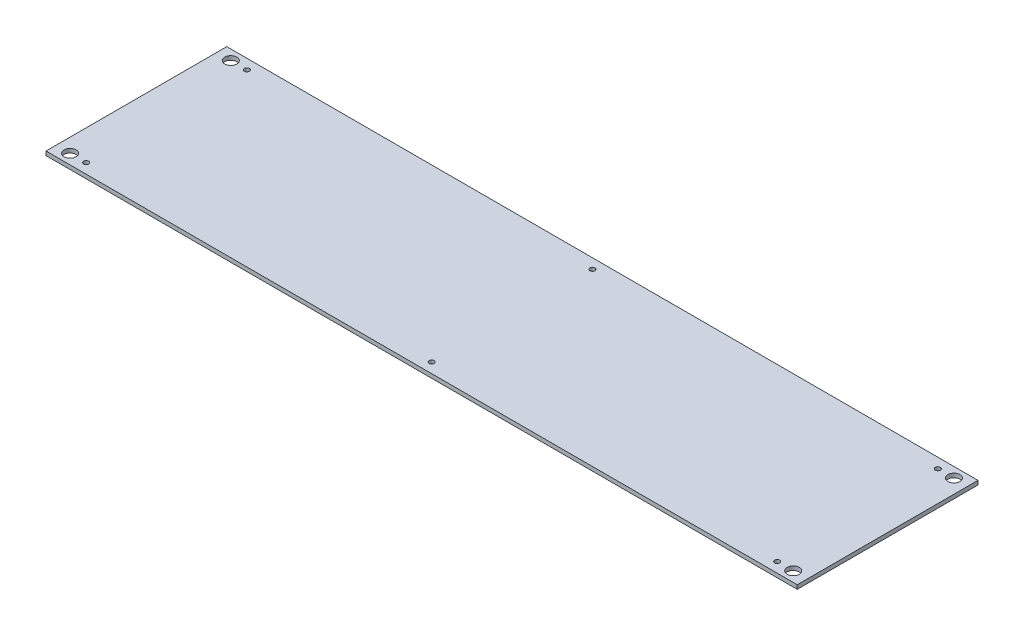
ISO-10303-21;
HEADER;
FILE_DESCRIPTION(('STEP AP214'),'2;1');
FILE_NAME('part.step','',(''),(''),'','','');
FILE_SCHEMA(('AUTOMOTIVE_DESIGN { 1 0 10303 214 1 1 1 1 }'));
ENDSEC;
DATA;
#1=APPLICATION_CONTEXT('core data for automotive mechanical design processes');
#2=APPLICATION_PROTOCOL_DEFINITION('international standard','automotive_design',2000,#1);
#3=PRODUCT_CONTEXT('',#1,'mechanical');
#4=PRODUCT('Part','Part','',(#3));
#5=PRODUCT_RELATED_PRODUCT_CATEGORY('part','',(#4));
#6=PRODUCT_DEFINITION_FORMATION('','',#4);
#7=PRODUCT_DEFINITION_CONTEXT('part definition',#1,'design');
#8=PRODUCT_DEFINITION('design','',#6,#7);
#9=PRODUCT_DEFINITION_SHAPE('','',#8);
#10=(LENGTH_UNIT() NAMED_UNIT(*) SI_UNIT(.MILLI.,.METRE.));
#11=(NAMED_UNIT(*) PLANE_ANGLE_UNIT() SI_UNIT($,.RADIAN.));
#12=(NAMED_UNIT(*) SI_UNIT($,.STERADIAN.) SOLID_ANGLE_UNIT());
#13=UNCERTAINTY_MEASURE_WITH_UNIT(LENGTH_MEASURE(1.E-05),#10,'distance_accuracy_value','');
#14=(GEOMETRIC_REPRESENTATION_CONTEXT(3) GLOBAL_UNCERTAINTY_ASSIGNED_CONTEXT((#13)) GLOBAL_UNIT_ASSIGNED_CONTEXT((#10,
#11,#12)) REPRESENTATION_CONTEXT('',''));
#15=CARTESIAN_POINT('',(0.,0.,0.));
#16=DIRECTION('',(0.,0.,1.));
#17=DIRECTION('',(1.,0.,0.));
#18=AXIS2_PLACEMENT_3D('',#15,#16,#17);
#19=CARTESIAN_POINT('',(0.,4.,0.));
#20=DIRECTION('',(0.,-1.,0.));
#21=DIRECTION('',(0.,0.,-1.));
#22=AXIS2_PLACEMENT_3D('',#19,#20,#21);
#23=PLANE('',#22);
#24=DIRECTION('',(0.,0.,-1.));
#25=VECTOR('',#24,1.);
#26=CARTESIAN_POINT('',(374.,4.,89.9999999999997));
#27=LINE('',#26,#25);
#28=CARTESIAN_POINT('',(374.,4.,89.9999999999997));
#29=VERTEX_POINT('',#28);
#30=CARTESIAN_POINT('',(374.,4.,-89.9999999999997));
#31=VERTEX_POINT('',#30);
#32=EDGE_CURVE('E92',#29,#31,#27,.T.);
#33=ORIENTED_EDGE('',*,*,#32,.T.);
#34=DIRECTION('',(-1.,0.,0.));
#35=VECTOR('',#34,1.);
#36=CARTESIAN_POINT('',(-374.,4.,-90.));
#37=LINE('',#36,#35);
#38=CARTESIAN_POINT('',(-374.,4.,-90.));
#39=VERTEX_POINT('',#38);
#40=EDGE_CURVE('E87',#31,#39,#37,.T.);
#41=ORIENTED_EDGE('',*,*,#40,.T.);
#42=DIRECTION('',(0.,0.,1.));
#43=VECTOR('',#42,1.);
#44=CARTESIAN_POINT('',(-374.,4.,90.));
#45=LINE('',#44,#43);
#46=CARTESIAN_POINT('',(-374.,4.,90.));
#47=VERTEX_POINT('',#46);
#48=EDGE_CURVE('E90',#39,#47,#45,.T.);
#49=ORIENTED_EDGE('',*,*,#48,.T.);
#50=DIRECTION('',(1.,0.,0.));
#51=VECTOR('',#50,1.);
#52=CARTESIAN_POINT('',(-374.,4.,90.));
#53=LINE('',#52,#51);
#54=EDGE_CURVE('E57',#47,#29,#53,.T.);
#55=ORIENTED_EDGE('',*,*,#54,.T.);
#56=EDGE_LOOP('',(#33,#41,#49,#55));
#57=FACE_BOUND('',#56,.T.);
#58=CARTESIAN_POINT('',(-344.,4.,-80.));
#59=DIRECTION('',(0.,1.,0.));
#60=DIRECTION('',(0.,0.,1.));
#61=AXIS2_PLACEMENT_3D('',#58,#59,#60);
#62=CIRCLE('',#61,2.50000000000002);
#63=CARTESIAN_POINT('',(-344.,4.,-77.5));
#64=VERTEX_POINT('',#63);
#65=EDGE_CURVE('E112',#64,#64,#62,.T.);
#66=ORIENTED_EDGE('',*,*,#65,.F.);
#67=EDGE_LOOP('',(#66));
#68=FACE_BOUND('',#67,.T.);
#69=CARTESIAN_POINT('',(344.,4.,-80.0000000000001));
#70=DIRECTION('',(0.,1.,0.));
#71=DIRECTION('',(0.,0.,-1.));
#72=AXIS2_PLACEMENT_3D('',#69,#70,#71);
#73=CIRCLE('',#72,2.50000000000002);
#74=CARTESIAN_POINT('',(344.,4.,-82.5000000000001));
#75=VERTEX_POINT('',#74);
#76=EDGE_CURVE('E134',#75,#75,#73,.T.);
#77=ORIENTED_EDGE('',*,*,#76,.F.);
#78=EDGE_LOOP('',(#77));
#79=FACE_BOUND('',#78,.T.);
#80=CARTESIAN_POINT('',(0.,4.,-80.));
#81=DIRECTION('',(0.,1.,0.));
#82=DIRECTION('',(0.,0.,1.));
#83=AXIS2_PLACEMENT_3D('',#80,#81,#82);
#84=CIRCLE('',#83,2.5);
#85=CARTESIAN_POINT('',(0.,4.,-77.5));
#86=VERTEX_POINT('',#85);
#87=EDGE_CURVE('E142',#86,#86,#84,.T.);
#88=ORIENTED_EDGE('',*,*,#87,.F.);
#89=EDGE_LOOP('',(#88));
#90=FACE_BOUND('',#89,.T.);
#91=CARTESIAN_POINT('',(-344.,4.,80.));
#92=DIRECTION('',(0.,1.,0.));
#93=DIRECTION('',(0.,0.,-1.));
#94=AXIS2_PLACEMENT_3D('',#91,#92,#93);
#95=CIRCLE('',#94,2.50000000000002);
#96=CARTESIAN_POINT('',(-344.,4.,77.5));
#97=VERTEX_POINT('',#96);
#98=EDGE_CURVE('E150',#97,#97,#95,.T.);
#99=ORIENTED_EDGE('',*,*,#98,.F.);
#100=EDGE_LOOP('',(#99));
#101=FACE_BOUND('',#100,.T.);
#102=CARTESIAN_POINT('',(0.,4.,80.0000000000001));
#103=DIRECTION('',(0.,1.,0.));
#104=DIRECTION('',(0.,0.,-1.));
#105=AXIS2_PLACEMENT_3D('',#102,#103,#104);
#106=CIRCLE('',#105,2.5);
#107=CARTESIAN_POINT('',(0.,4.,77.5000000000001));
#108=VERTEX_POINT('',#107);
#109=EDGE_CURVE('E158',#108,#108,#106,.T.);
#110=ORIENTED_EDGE('',*,*,#109,.F.);
#111=EDGE_LOOP('',(#110));
#112=FACE_BOUND('',#111,.T.);
#113=CARTESIAN_POINT('',(344.,4.,80.0000000000001));
#114=DIRECTION('',(0.,1.,0.));
#115=DIRECTION('',(0.,0.,1.));
#116=AXIS2_PLACEMENT_3D('',#113,#114,#115);
#117=CIRCLE('',#116,2.50000000000002);
#118=CARTESIAN_POINT('',(344.,4.,82.5000000000001));
#119=VERTEX_POINT('',#118);
#120=EDGE_CURVE('E166',#119,#119,#117,.T.);
#121=ORIENTED_EDGE('',*,*,#120,.F.);
#122=EDGE_LOOP('',(#121));
#123=FACE_BOUND('',#122,.T.);
#124=CARTESIAN_POINT('',(-360.,4.,-80.));
#125=DIRECTION('',(0.,1.,0.));
#126=DIRECTION('',(0.,0.,1.));
#127=AXIS2_PLACEMENT_3D('',#124,#125,#126);
#128=CIRCLE('',#127,5.99999999999999);
#129=CARTESIAN_POINT('',(-360.,4.,-74.));
#130=VERTEX_POINT('',#129);
#131=EDGE_CURVE('E174',#130,#130,#128,.T.);
#132=ORIENTED_EDGE('',*,*,#131,.F.);
#133=EDGE_LOOP('',(#132));
#134=FACE_BOUND('',#133,.T.);
#135=CARTESIAN_POINT('',(-360.,4.,80.));
#136=DIRECTION('',(0.,1.,0.));
#137=DIRECTION('',(0.,0.,-1.));
#138=AXIS2_PLACEMENT_3D('',#135,#136,#137);
#139=CIRCLE('',#138,5.99999999999999);
#140=CARTESIAN_POINT('',(-360.,4.,74.));
#141=VERTEX_POINT('',#140);
#142=EDGE_CURVE('E182',#141,#141,#139,.T.);
#143=ORIENTED_EDGE('',*,*,#142,.F.);
#144=EDGE_LOOP('',(#143));
#145=FACE_BOUND('',#144,.T.);
#146=CARTESIAN_POINT('',(360.,4.,79.9999999999999));
#147=DIRECTION('',(0.,1.,0.));
#148=DIRECTION('',(0.,0.,1.));
#149=AXIS2_PLACEMENT_3D('',#146,#147,#148);
#150=CIRCLE('',#149,5.99999999999999);
#151=CARTESIAN_POINT('',(360.,4.,85.9999999999999));
#152=VERTEX_POINT('',#151);
#153=EDGE_CURVE('E190',#152,#152,#150,.T.);
#154=ORIENTED_EDGE('',*,*,#153,.F.);
#155=EDGE_LOOP('',(#154));
#156=FACE_BOUND('',#155,.T.);
#157=CARTESIAN_POINT('',(360.,4.,-80.));
#158=DIRECTION('',(0.,1.,0.));
#159=DIRECTION('',(0.,0.,-1.));
#160=AXIS2_PLACEMENT_3D('',#157,#158,#159);
#161=CIRCLE('',#160,5.99999999999999);
#162=CARTESIAN_POINT('',(360.,4.,-86.));
#163=VERTEX_POINT('',#162);
#164=EDGE_CURVE('E198',#163,#163,#161,.T.);
#165=ORIENTED_EDGE('',*,*,#164,.F.);
#166=EDGE_LOOP('',(#165));
#167=FACE_BOUND('',#166,.T.);
#168=ADVANCED_FACE('F39',(#57,#68,#79,#90,#101,#112,#123,#134,#145,#156,#167),#23,.F.);
#169=CARTESIAN_POINT('',(0.,0.,0.));
#170=DIRECTION('',(0.,-1.,0.));
#171=DIRECTION('',(0.,0.,-1.));
#172=AXIS2_PLACEMENT_3D('',#169,#170,#171);
#173=PLANE('',#172);
#174=CARTESIAN_POINT('',(360.,0.,79.9999999999999));
#175=DIRECTION('',(0.,1.,0.));
#176=DIRECTION('',(0.,0.,1.));
#177=AXIS2_PLACEMENT_3D('',#174,#175,#176);
#178=CIRCLE('',#177,5.99999999999999);
#179=CARTESIAN_POINT('',(360.,0.,85.9999999999999));
#180=VERTEX_POINT('',#179);
#181=EDGE_CURVE('E194',#180,#180,#178,.T.);
#182=ORIENTED_EDGE('',*,*,#181,.T.);
#183=EDGE_LOOP('',(#182));
#184=FACE_BOUND('',#183,.T.);
#185=CARTESIAN_POINT('',(-360.,0.,-80.));
#186=DIRECTION('',(0.,1.,0.));
#187=DIRECTION('',(0.,0.,1.));
#188=AXIS2_PLACEMENT_3D('',#185,#186,#187);
#189=CIRCLE('',#188,5.99999999999999);
#190=CARTESIAN_POINT('',(-360.,0.,-74.));
#191=VERTEX_POINT('',#190);
#192=EDGE_CURVE('E178',#191,#191,#189,.T.);
#193=ORIENTED_EDGE('',*,*,#192,.T.);
#194=EDGE_LOOP('',(#193));
#195=FACE_BOUND('',#194,.T.);
#196=CARTESIAN_POINT('',(0.,0.,80.0000000000001));
#197=DIRECTION('',(0.,1.,0.));
#198=DIRECTION('',(0.,0.,-1.));
#199=AXIS2_PLACEMENT_3D('',#196,#197,#198);
#200=CIRCLE('',#199,2.5);
#201=CARTESIAN_POINT('',(0.,0.,77.5000000000001));
#202=VERTEX_POINT('',#201);
#203=EDGE_CURVE('E162',#202,#202,#200,.T.);
#204=ORIENTED_EDGE('',*,*,#203,.T.);
#205=EDGE_LOOP('',(#204));
#206=FACE_BOUND('',#205,.T.);
#207=CARTESIAN_POINT('',(0.,0.,-80.));
#208=DIRECTION('',(0.,1.,0.));
#209=DIRECTION('',(0.,0.,1.));
#210=AXIS2_PLACEMENT_3D('',#207,#208,#209);
#211=CIRCLE('',#210,2.5);
#212=CARTESIAN_POINT('',(0.,0.,-77.5));
#213=VERTEX_POINT('',#212);
#214=EDGE_CURVE('E146',#213,#213,#211,.T.);
#215=ORIENTED_EDGE('',*,*,#214,.T.);
#216=EDGE_LOOP('',(#215));
#217=FACE_BOUND('',#216,.T.);
#218=CARTESIAN_POINT('',(-344.,0.,-80.));
#219=DIRECTION('',(0.,1.,0.));
#220=DIRECTION('',(0.,0.,1.));
#221=AXIS2_PLACEMENT_3D('',#218,#219,#220);
#222=CIRCLE('',#221,2.50000000000002);
#223=CARTESIAN_POINT('',(-344.,0.,-77.5));
#224=VERTEX_POINT('',#223);
#225=EDGE_CURVE('E130',#224,#224,#222,.T.);
#226=ORIENTED_EDGE('',*,*,#225,.T.);
#227=EDGE_LOOP('',(#226));
#228=FACE_BOUND('',#227,.T.);
#229=DIRECTION('',(0.,0.,-1.));
#230=VECTOR('',#229,1.);
#231=CARTESIAN_POINT('',(374.,0.,89.9999999999997));
#232=LINE('',#231,#230);
#233=CARTESIAN_POINT('',(374.,0.,89.9999999999997));
#234=VERTEX_POINT('',#233);
#235=CARTESIAN_POINT('',(374.,0.,-89.9999999999997));
#236=VERTEX_POINT('',#235);
#237=EDGE_CURVE('E108',#234,#236,#232,.T.);
#238=ORIENTED_EDGE('',*,*,#237,.F.);
#239=DIRECTION('',(1.,0.,0.));
#240=VECTOR('',#239,1.);
#241=CARTESIAN_POINT('',(-374.,0.,90.));
#242=LINE('',#241,#240);
#243=CARTESIAN_POINT('',(-374.,0.,90.));
#244=VERTEX_POINT('',#243);
#245=EDGE_CURVE('E80',#244,#234,#242,.T.);
#246=ORIENTED_EDGE('',*,*,#245,.F.);
#247=DIRECTION('',(0.,0.,1.));
#248=VECTOR('',#247,1.);
#249=CARTESIAN_POINT('',(-374.,0.,90.));
#250=LINE('',#249,#248);
#251=CARTESIAN_POINT('',(-374.,0.,-90.));
#252=VERTEX_POINT('',#251);
#253=EDGE_CURVE('E74',#252,#244,#250,.T.);
#254=ORIENTED_EDGE('',*,*,#253,.F.);
#255=DIRECTION('',(-1.,0.,0.));
#256=VECTOR('',#255,1.);
#257=CARTESIAN_POINT('',(-374.,0.,-90.));
#258=LINE('',#257,#256);
#259=EDGE_CURVE('E97',#236,#252,#258,.T.);
#260=ORIENTED_EDGE('',*,*,#259,.F.);
#261=EDGE_LOOP('',(#238,#246,#254,#260));
#262=FACE_BOUND('',#261,.T.);
#263=CARTESIAN_POINT('',(344.,0.,-80.0000000000001));
#264=DIRECTION('',(0.,1.,0.));
#265=DIRECTION('',(0.,0.,-1.));
#266=AXIS2_PLACEMENT_3D('',#263,#264,#265);
#267=CIRCLE('',#266,2.50000000000002);
#268=CARTESIAN_POINT('',(344.,0.,-82.5000000000001));
#269=VERTEX_POINT('',#268);
#270=EDGE_CURVE('E138',#269,#269,#267,.T.);
#271=ORIENTED_EDGE('',*,*,#270,.T.);
#272=EDGE_LOOP('',(#271));
#273=FACE_BOUND('',#272,.T.);
#274=CARTESIAN_POINT('',(-344.,0.,80.));
#275=DIRECTION('',(0.,1.,0.));
#276=DIRECTION('',(0.,0.,-1.));
#277=AXIS2_PLACEMENT_3D('',#274,#275,#276);
#278=CIRCLE('',#277,2.50000000000002);
#279=CARTESIAN_POINT('',(-344.,0.,77.5));
#280=VERTEX_POINT('',#279);
#281=EDGE_CURVE('E154',#280,#280,#278,.T.);
#282=ORIENTED_EDGE('',*,*,#281,.T.);
#283=EDGE_LOOP('',(#282));
#284=FACE_BOUND('',#283,.T.);
#285=CARTESIAN_POINT('',(344.,0.,80.0000000000001));
#286=DIRECTION('',(0.,1.,0.));
#287=DIRECTION('',(0.,0.,1.));
#288=AXIS2_PLACEMENT_3D('',#285,#286,#287);
#289=CIRCLE('',#288,2.50000000000002);
#290=CARTESIAN_POINT('',(344.,0.,82.5000000000001));
#291=VERTEX_POINT('',#290);
#292=EDGE_CURVE('E170',#291,#291,#289,.T.);
#293=ORIENTED_EDGE('',*,*,#292,.T.);
#294=EDGE_LOOP('',(#293));
#295=FACE_BOUND('',#294,.T.);
#296=CARTESIAN_POINT('',(-360.,0.,80.));
#297=DIRECTION('',(0.,1.,0.));
#298=DIRECTION('',(0.,0.,-1.));
#299=AXIS2_PLACEMENT_3D('',#296,#297,#298);
#300=CIRCLE('',#299,5.99999999999999);
#301=CARTESIAN_POINT('',(-360.,0.,74.));
#302=VERTEX_POINT('',#301);
#303=EDGE_CURVE('E186',#302,#302,#300,.T.);
#304=ORIENTED_EDGE('',*,*,#303,.T.);
#305=EDGE_LOOP('',(#304));
#306=FACE_BOUND('',#305,.T.);
#307=CARTESIAN_POINT('',(360.,0.,-80.));
#308=DIRECTION('',(0.,1.,0.));
#309=DIRECTION('',(0.,0.,-1.));
#310=AXIS2_PLACEMENT_3D('',#307,#308,#309);
#311=CIRCLE('',#310,5.99999999999999);
#312=CARTESIAN_POINT('',(360.,0.,-86.));
#313=VERTEX_POINT('',#312);
#314=EDGE_CURVE('E202',#313,#313,#311,.T.);
#315=ORIENTED_EDGE('',*,*,#314,.T.);
#316=EDGE_LOOP('',(#315));
#317=FACE_BOUND('',#316,.T.);
#318=ADVANCED_FACE('F125',(#184,#195,#206,#217,#228,#262,#273,#284,#295,#306,#317),#173,.T.);
#319=CARTESIAN_POINT('',(374.,4.,89.9999999999997));
#320=DIRECTION('',(-1.,0.,0.));
#321=DIRECTION('',(0.,0.,1.));
#322=AXIS2_PLACEMENT_3D('',#319,#320,#321);
#323=PLANE('',#322);
#324=ORIENTED_EDGE('',*,*,#237,.T.);
#325=DIRECTION('',(0.,-1.,0.));
#326=VECTOR('',#325,1.);
#327=CARTESIAN_POINT('',(374.,4.,-89.9999999999997));
#328=LINE('',#327,#326);
#329=EDGE_CURVE('E11',#31,#236,#328,.T.);
#330=ORIENTED_EDGE('',*,*,#329,.F.);
#331=ORIENTED_EDGE('',*,*,#32,.F.);
#332=DIRECTION('',(0.,-1.,0.));
#333=VECTOR('',#332,1.);
#334=CARTESIAN_POINT('',(374.,4.,89.9999999999997));
#335=LINE('',#334,#333);
#336=EDGE_CURVE('E104',#29,#234,#335,.T.);
#337=ORIENTED_EDGE('',*,*,#336,.T.);
#338=EDGE_LOOP('',(#324,#330,#331,#337));
#339=FACE_BOUND('',#338,.T.);
#340=ADVANCED_FACE('F41',(#339),#323,.F.);
#341=CARTESIAN_POINT('',(-374.,4.,-90.));
#342=DIRECTION('',(0.,0.,1.));
#343=DIRECTION('',(1.,0.,0.));
#344=AXIS2_PLACEMENT_3D('',#341,#342,#343);
#345=PLANE('',#344);
#346=ORIENTED_EDGE('',*,*,#259,.T.);
#347=DIRECTION('',(0.,-1.,0.));
#348=VECTOR('',#347,1.);
#349=CARTESIAN_POINT('',(-374.,4.,-90.));
#350=LINE('',#349,#348);
#351=EDGE_CURVE('E49',#39,#252,#350,.T.);
#352=ORIENTED_EDGE('',*,*,#351,.F.);
#353=ORIENTED_EDGE('',*,*,#40,.F.);
#354=ORIENTED_EDGE('',*,*,#329,.T.);
#355=EDGE_LOOP('',(#346,#352,#353,#354));
#356=FACE_BOUND('',#355,.T.);
#357=ADVANCED_FACE('F96',(#356),#345,.F.);
#358=CARTESIAN_POINT('',(-374.,4.,90.));
#359=DIRECTION('',(1.,0.,0.));
#360=DIRECTION('',(0.,0.,-1.));
#361=AXIS2_PLACEMENT_3D('',#358,#359,#360);
#362=PLANE('',#361);
#363=ORIENTED_EDGE('',*,*,#253,.T.);
#364=DIRECTION('',(0.,-1.,0.));
#365=VECTOR('',#364,1.);
#366=CARTESIAN_POINT('',(-374.,4.,90.));
#367=LINE('',#366,#365);
#368=EDGE_CURVE('E99',#47,#244,#367,.T.);
#369=ORIENTED_EDGE('',*,*,#368,.F.);
#370=ORIENTED_EDGE('',*,*,#48,.F.);
#371=ORIENTED_EDGE('',*,*,#351,.T.);
#372=EDGE_LOOP('',(#363,#369,#370,#371));
#373=FACE_BOUND('',#372,.T.);
#374=ADVANCED_FACE('F100',(#373),#362,.F.);
#375=CARTESIAN_POINT('',(-374.,4.,90.));
#376=DIRECTION('',(0.,0.,-1.));
#377=DIRECTION('',(-1.,0.,0.));
#378=AXIS2_PLACEMENT_3D('',#375,#376,#377);
#379=PLANE('',#378);
#380=ORIENTED_EDGE('',*,*,#245,.T.);
#381=ORIENTED_EDGE('',*,*,#336,.F.);
#382=ORIENTED_EDGE('',*,*,#54,.F.);
#383=ORIENTED_EDGE('',*,*,#368,.T.);
#384=EDGE_LOOP('',(#380,#381,#382,#383));
#385=FACE_BOUND('',#384,.T.);
#386=ADVANCED_FACE('F122',(#385),#379,.F.);
#387=CARTESIAN_POINT('',(-344.,4.,-80.));
#388=DIRECTION('',(0.,-1.,0.));
#389=DIRECTION('',(0.,0.,-1.));
#390=AXIS2_PLACEMENT_3D('',#387,#388,#389);
#391=CYLINDRICAL_SURFACE('',#390,2.50000000000002);
#392=ORIENTED_EDGE('',*,*,#65,.T.);
#393=EDGE_LOOP('',(#392));
#394=FACE_BOUND('',#393,.T.);
#395=ORIENTED_EDGE('',*,*,#225,.F.);
#396=EDGE_LOOP('',(#395));
#397=FACE_BOUND('',#396,.T.);
#398=ADVANCED_FACE('F221',(#394,#397),#391,.F.);
#399=CARTESIAN_POINT('',(344.,4.,-80.0000000000001));
#400=DIRECTION('',(0.,-1.,0.));
#401=DIRECTION('',(0.,0.,-1.));
#402=AXIS2_PLACEMENT_3D('',#399,#400,#401);
#403=CYLINDRICAL_SURFACE('',#402,2.50000000000002);
#404=ORIENTED_EDGE('',*,*,#76,.T.);
#405=EDGE_LOOP('',(#404));
#406=FACE_BOUND('',#405,.T.);
#407=ORIENTED_EDGE('',*,*,#270,.F.);
#408=EDGE_LOOP('',(#407));
#409=FACE_BOUND('',#408,.T.);
#410=ADVANCED_FACE('F267',(#406,#409),#403,.F.);
#411=CARTESIAN_POINT('',(0.,4.,-80.));
#412=DIRECTION('',(0.,-1.,0.));
#413=DIRECTION('',(0.,0.,-1.));
#414=AXIS2_PLACEMENT_3D('',#411,#412,#413);
#415=CYLINDRICAL_SURFACE('',#414,2.5);
#416=ORIENTED_EDGE('',*,*,#87,.T.);
#417=EDGE_LOOP('',(#416));
#418=FACE_BOUND('',#417,.T.);
#419=ORIENTED_EDGE('',*,*,#214,.F.);
#420=EDGE_LOOP('',(#419));
#421=FACE_BOUND('',#420,.T.);
#422=ADVANCED_FACE('F275',(#418,#421),#415,.F.);
#423=CARTESIAN_POINT('',(-344.,4.,80.));
#424=DIRECTION('',(0.,-1.,0.));
#425=DIRECTION('',(0.,0.,-1.));
#426=AXIS2_PLACEMENT_3D('',#423,#424,#425);
#427=CYLINDRICAL_SURFACE('',#426,2.50000000000002);
#428=ORIENTED_EDGE('',*,*,#98,.T.);
#429=EDGE_LOOP('',(#428));
#430=FACE_BOUND('',#429,.T.);
#431=ORIENTED_EDGE('',*,*,#281,.F.);
#432=EDGE_LOOP('',(#431));
#433=FACE_BOUND('',#432,.T.);
#434=ADVANCED_FACE('F283',(#430,#433),#427,.F.);
#435=CARTESIAN_POINT('',(0.,4.,80.0000000000001));
#436=DIRECTION('',(0.,-1.,0.));
#437=DIRECTION('',(0.,0.,-1.));
#438=AXIS2_PLACEMENT_3D('',#435,#436,#437);
#439=CYLINDRICAL_SURFACE('',#438,2.5);
#440=ORIENTED_EDGE('',*,*,#109,.T.);
#441=EDGE_LOOP('',(#440));
#442=FACE_BOUND('',#441,.T.);
#443=ORIENTED_EDGE('',*,*,#203,.F.);
#444=EDGE_LOOP('',(#443));
#445=FACE_BOUND('',#444,.T.);
#446=ADVANCED_FACE('F292',(#442,#445),#439,.F.);
#447=CARTESIAN_POINT('',(344.,4.,80.0000000000001));
#448=DIRECTION('',(0.,-1.,0.));
#449=DIRECTION('',(0.,0.,-1.));
#450=AXIS2_PLACEMENT_3D('',#447,#448,#449);
#451=CYLINDRICAL_SURFACE('',#450,2.50000000000002);
#452=ORIENTED_EDGE('',*,*,#120,.T.);
#453=EDGE_LOOP('',(#452));
#454=FACE_BOUND('',#453,.T.);
#455=ORIENTED_EDGE('',*,*,#292,.F.);
#456=EDGE_LOOP('',(#455));
#457=FACE_BOUND('',#456,.T.);
#458=ADVANCED_FACE('F301',(#454,#457),#451,.F.);
#459=CARTESIAN_POINT('',(-360.,4.,-80.));
#460=DIRECTION('',(0.,-1.,0.));
#461=DIRECTION('',(0.,0.,-1.));
#462=AXIS2_PLACEMENT_3D('',#459,#460,#461);
#463=CYLINDRICAL_SURFACE('',#462,5.99999999999999);
#464=ORIENTED_EDGE('',*,*,#131,.T.);
#465=EDGE_LOOP('',(#464));
#466=FACE_BOUND('',#465,.T.);
#467=ORIENTED_EDGE('',*,*,#192,.F.);
#468=EDGE_LOOP('',(#467));
#469=FACE_BOUND('',#468,.T.);
#470=ADVANCED_FACE('F310',(#466,#469),#463,.F.);
#471=CARTESIAN_POINT('',(-360.,4.,80.));
#472=DIRECTION('',(0.,-1.,0.));
#473=DIRECTION('',(0.,0.,-1.));
#474=AXIS2_PLACEMENT_3D('',#471,#472,#473);
#475=CYLINDRICAL_SURFACE('',#474,5.99999999999999);
#476=ORIENTED_EDGE('',*,*,#142,.T.);
#477=EDGE_LOOP('',(#476));
#478=FACE_BOUND('',#477,.T.);
#479=ORIENTED_EDGE('',*,*,#303,.F.);
#480=EDGE_LOOP('',(#479));
#481=FACE_BOUND('',#480,.T.);
#482=ADVANCED_FACE('F319',(#478,#481),#475,.F.);
#483=CARTESIAN_POINT('',(360.,4.,79.9999999999999));
#484=DIRECTION('',(0.,-1.,0.));
#485=DIRECTION('',(0.,0.,-1.));
#486=AXIS2_PLACEMENT_3D('',#483,#484,#485);
#487=CYLINDRICAL_SURFACE('',#486,5.99999999999999);
#488=ORIENTED_EDGE('',*,*,#153,.T.);
#489=EDGE_LOOP('',(#488));
#490=FACE_BOUND('',#489,.T.);
#491=ORIENTED_EDGE('',*,*,#181,.F.);
#492=EDGE_LOOP('',(#491));
#493=FACE_BOUND('',#492,.T.);
#494=ADVANCED_FACE('F328',(#490,#493),#487,.F.);
#495=CARTESIAN_POINT('',(360.,4.,-80.));
#496=DIRECTION('',(0.,-1.,0.));
#497=DIRECTION('',(0.,0.,-1.));
#498=AXIS2_PLACEMENT_3D('',#495,#496,#497);
#499=CYLINDRICAL_SURFACE('',#498,5.99999999999999);
#500=ORIENTED_EDGE('',*,*,#164,.T.);
#501=EDGE_LOOP('',(#500));
#502=FACE_BOUND('',#501,.T.);
#503=ORIENTED_EDGE('',*,*,#314,.F.);
#504=EDGE_LOOP('',(#503));
#505=FACE_BOUND('',#504,.T.);
#506=ADVANCED_FACE('F210',(#502,#505),#499,.F.);
#507=CLOSED_SHELL('',(#168,#318,#340,#357,#374,#386,#398,#410,#422,#434,#446,#458,#470,#482,
#494,#506));
#508=MANIFOLD_SOLID_BREP('B2',#507);
#509=ADVANCED_BREP_SHAPE_REPRESENTATION('',(#18,#508),#14);
#510=SHAPE_DEFINITION_REPRESENTATION(#9,#509);
ENDSEC;
END-ISO-10303-21;
